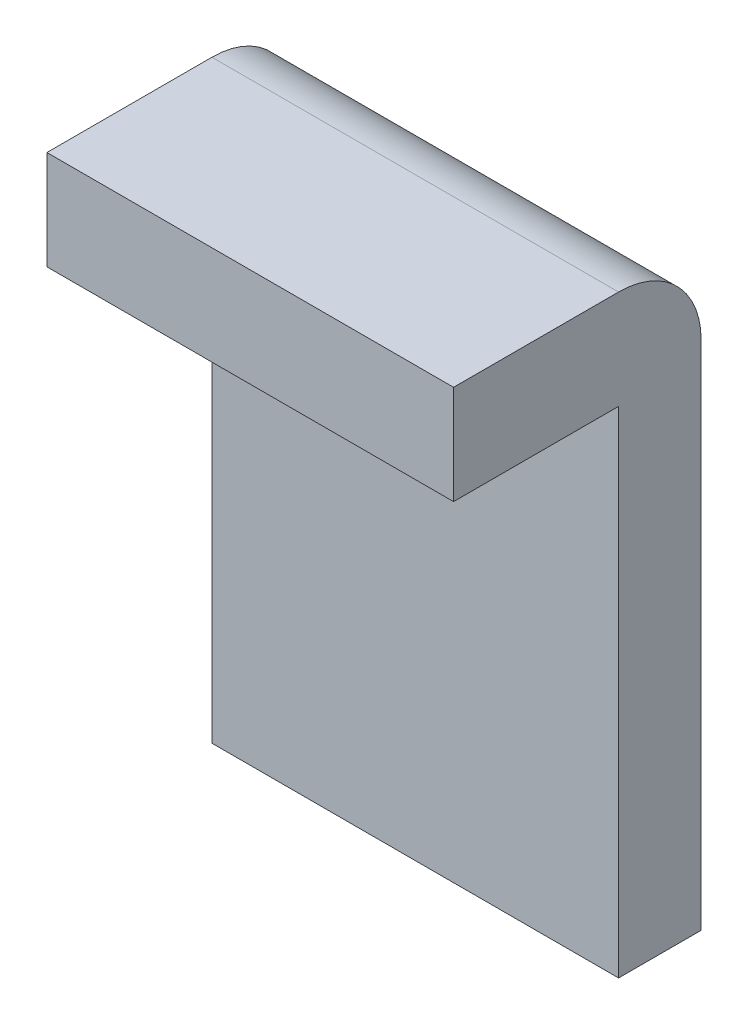
ISO-10303-21;
HEADER;
FILE_DESCRIPTION(('STEP AP214'),'2;1');
FILE_NAME('part.step','',(''),(''),'','','');
FILE_SCHEMA(('AUTOMOTIVE_DESIGN { 1 0 10303 214 1 1 1 1 }'));
ENDSEC;
DATA;
#1=APPLICATION_CONTEXT('core data for automotive mechanical design processes');
#2=APPLICATION_PROTOCOL_DEFINITION('international standard','automotive_design',2000,#1);
#3=PRODUCT_CONTEXT('',#1,'mechanical');
#4=PRODUCT('Part','Part','',(#3));
#5=PRODUCT_RELATED_PRODUCT_CATEGORY('part','',(#4));
#6=PRODUCT_DEFINITION_FORMATION('','',#4);
#7=PRODUCT_DEFINITION_CONTEXT('part definition',#1,'design');
#8=PRODUCT_DEFINITION('design','',#6,#7);
#9=PRODUCT_DEFINITION_SHAPE('','',#8);
#10=(LENGTH_UNIT() NAMED_UNIT(*) SI_UNIT(.MILLI.,.METRE.));
#11=(NAMED_UNIT(*) PLANE_ANGLE_UNIT() SI_UNIT($,.RADIAN.));
#12=(NAMED_UNIT(*) SI_UNIT($,.STERADIAN.) SOLID_ANGLE_UNIT());
#13=UNCERTAINTY_MEASURE_WITH_UNIT(LENGTH_MEASURE(1.E-05),#10,'distance_accuracy_value','');
#14=(GEOMETRIC_REPRESENTATION_CONTEXT(3) GLOBAL_UNCERTAINTY_ASSIGNED_CONTEXT((#13)) GLOBAL_UNIT_ASSIGNED_CONTEXT((#10,
#11,#12)) REPRESENTATION_CONTEXT('',''));
#15=CARTESIAN_POINT('',(0.,0.,0.));
#16=DIRECTION('',(0.,0.,1.));
#17=DIRECTION('',(1.,0.,0.));
#18=AXIS2_PLACEMENT_3D('',#15,#16,#17);
#19=CARTESIAN_POINT('',(-8.34906661620967,8.30000000000001,4.25467377707551));
#20=DIRECTION('',(0.,1.,0.));
#21=DIRECTION('',(0.,0.,1.));
#22=AXIS2_PLACEMENT_3D('',#19,#20,#21);
#23=PLANE('',#22);
#24=DIRECTION('',(1.,0.,0.));
#25=VECTOR('',#24,1.);
#26=CARTESIAN_POINT('',(26.7271967977103,8.30000000000001,4.25467377707551));
#27=LINE('',#26,#25);
#28=CARTESIAN_POINT('',(26.7271967977103,8.30000000000001,4.25467377707551));
#29=VERTEX_POINT('',#28);
#30=CARTESIAN_POINT('',(27.959347554151,8.30000000000001,4.25467377707551));
#31=VERTEX_POINT('',#30);
#32=EDGE_CURVE('E133',#29,#31,#27,.T.);
#33=ORIENTED_EDGE('',*,*,#32,.F.);
#34=DIRECTION('',(0.,0.,1.));
#35=VECTOR('',#34,1.);
#36=CARTESIAN_POINT('',(26.7271967977103,8.30000000000001,4.25467377707552));
#37=LINE('',#36,#35);
#38=CARTESIAN_POINT('',(26.7271967977103,8.30000000000001,3.75467377707551));
#39=VERTEX_POINT('',#38);
#40=EDGE_CURVE('E113',#39,#29,#37,.T.);
#41=ORIENTED_EDGE('',*,*,#40,.F.);
#42=DIRECTION('',(1.,0.,0.));
#43=VECTOR('',#42,1.);
#44=CARTESIAN_POINT('',(-8.34906661620967,8.30000000000001,3.75467377707551));
#45=LINE('',#44,#43);
#46=CARTESIAN_POINT('',(27.959347554151,8.30000000000001,3.75467377707551));
#47=VERTEX_POINT('',#46);
#48=EDGE_CURVE('E130',#39,#47,#45,.T.);
#49=ORIENTED_EDGE('',*,*,#48,.T.);
#50=DIRECTION('',(0.,0.,-1.));
#51=VECTOR('',#50,1.);
#52=CARTESIAN_POINT('',(27.959347554151,8.30000000000001,4.25467377707552));
#53=LINE('',#52,#51);
#54=EDGE_CURVE('E129',#31,#47,#53,.T.);
#55=ORIENTED_EDGE('',*,*,#54,.F.);
#56=EDGE_LOOP('',(#33,#41,#49,#55));
#57=FACE_BOUND('',#56,.T.);
#58=ADVANCED_FACE('F17',(#57),#23,.F.);
#59=CARTESIAN_POINT('',(26.7271967977103,5.35753839337144,4.25467377707552));
#60=DIRECTION('',(0.,0.,1.));
#61=DIRECTION('',(0.,-1.,0.));
#62=AXIS2_PLACEMENT_3D('',#59,#60,#61);
#63=PLANE('',#62);
#64=DIRECTION('',(1.,0.,0.));
#65=VECTOR('',#64,1.);
#66=CARTESIAN_POINT('',(-8.34906661620967,8.6,4.25467377707551));
#67=LINE('',#66,#65);
#68=CARTESIAN_POINT('',(27.959347554151,8.6,4.25467377707551));
#69=VERTEX_POINT('',#68);
#70=CARTESIAN_POINT('',(26.7271967977103,8.6,4.25467377707551));
#71=VERTEX_POINT('',#70);
#72=EDGE_CURVE('E131',#69,#71,#67,.F.);
#73=ORIENTED_EDGE('',*,*,#72,.T.);
#74=DIRECTION('',(0.,1.,0.));
#75=VECTOR('',#74,1.);
#76=CARTESIAN_POINT('',(26.7271967977103,5.35753839337144,4.25467377707551));
#77=LINE('',#76,#75);
#78=EDGE_CURVE('E136',#29,#71,#77,.T.);
#79=ORIENTED_EDGE('',*,*,#78,.F.);
#80=ORIENTED_EDGE('',*,*,#32,.T.);
#81=DIRECTION('',(0.,1.,0.));
#82=VECTOR('',#81,1.);
#83=CARTESIAN_POINT('',(27.959347554151,5.35753839337144,4.25467377707551));
#84=LINE('',#83,#82);
#85=EDGE_CURVE('E120',#69,#31,#84,.F.);
#86=ORIENTED_EDGE('',*,*,#85,.F.);
#87=EDGE_LOOP('',(#73,#79,#80,#86));
#88=FACE_BOUND('',#87,.T.);
#89=ADVANCED_FACE('F172',(#88),#63,.T.);
#90=CARTESIAN_POINT('',(-8.34906661620967,8.6,4.25467377707551));
#91=DIRECTION('',(0.,-1.,0.));
#92=DIRECTION('',(0.,0.,-1.));
#93=AXIS2_PLACEMENT_3D('',#90,#91,#92);
#94=PLANE('',#93);
#95=DIRECTION('',(1.,0.,0.));
#96=VECTOR('',#95,1.);
#97=CARTESIAN_POINT('',(-8.34906661620967,8.6,3.75467377707551));
#98=LINE('',#97,#96);
#99=CARTESIAN_POINT('',(26.7271967977103,8.6,3.7546737770755));
#100=VERTEX_POINT('',#99);
#101=CARTESIAN_POINT('',(27.959347554151,8.6,3.7546737770755));
#102=VERTEX_POINT('',#101);
#103=EDGE_CURVE('E79',#100,#102,#98,.T.);
#104=ORIENTED_EDGE('',*,*,#103,.F.);
#105=DIRECTION('',(0.,0.,1.));
#106=VECTOR('',#105,1.);
#107=CARTESIAN_POINT('',(26.7271967977103,8.6,4.25467377707552));
#108=LINE('',#107,#106);
#109=EDGE_CURVE('E139',#71,#100,#108,.F.);
#110=ORIENTED_EDGE('',*,*,#109,.F.);
#111=ORIENTED_EDGE('',*,*,#72,.F.);
#112=DIRECTION('',(0.,0.,-1.));
#113=VECTOR('',#112,1.);
#114=CARTESIAN_POINT('',(27.959347554151,8.6,4.25467377707552));
#115=LINE('',#114,#113);
#116=EDGE_CURVE('E83',#102,#69,#115,.F.);
#117=ORIENTED_EDGE('',*,*,#116,.F.);
#118=EDGE_LOOP('',(#104,#110,#111,#117));
#119=FACE_BOUND('',#118,.T.);
#120=ADVANCED_FACE('F169',(#119),#94,.F.);
#121=CARTESIAN_POINT('',(-8.34906661620967,8.30000000000001,3.75467377707551));
#122=DIRECTION('',(0.,0.,-1.));
#123=DIRECTION('',(0.,1.,0.));
#124=AXIS2_PLACEMENT_3D('',#121,#122,#123);
#125=PLANE('',#124);
#126=ORIENTED_EDGE('',*,*,#48,.F.);
#127=DIRECTION('',(0.,1.,0.));
#128=VECTOR('',#127,1.);
#129=CARTESIAN_POINT('',(26.7271967977103,5.35753839337144,3.75467377707551));
#130=LINE('',#129,#128);
#131=CARTESIAN_POINT('',(26.7271967977103,6.8,3.75467377707551));
#132=VERTEX_POINT('',#131);
#133=EDGE_CURVE('E95',#132,#39,#130,.T.);
#134=ORIENTED_EDGE('',*,*,#133,.F.);
#135=DIRECTION('',(1.,0.,0.));
#136=VECTOR('',#135,1.);
#137=CARTESIAN_POINT('',(-15.8147962412963,6.8,3.75467377707551));
#138=LINE('',#137,#136);
#139=CARTESIAN_POINT('',(27.959347554151,6.8,3.75467377707551));
#140=VERTEX_POINT('',#139);
#141=EDGE_CURVE('E114',#140,#132,#138,.F.);
#142=ORIENTED_EDGE('',*,*,#141,.F.);
#143=DIRECTION('',(0.,1.,0.));
#144=VECTOR('',#143,1.);
#145=CARTESIAN_POINT('',(27.959347554151,5.35753839337144,3.75467377707551));
#146=LINE('',#145,#144);
#147=EDGE_CURVE('E84',#47,#140,#146,.F.);
#148=ORIENTED_EDGE('',*,*,#147,.F.);
#149=EDGE_LOOP('',(#126,#134,#142,#148));
#150=FACE_BOUND('',#149,.T.);
#151=ADVANCED_FACE('F178',(#150),#125,.F.);
#152=CARTESIAN_POINT('',(-8.34906661620967,8.35,3.7546737770755));
#153=DIRECTION('',(1.,0.,0.));
#154=DIRECTION('',(0.,0.,-1.));
#155=AXIS2_PLACEMENT_3D('',#152,#153,#154);
#156=CYLINDRICAL_SURFACE('',#155,0.249999999999996);
#157=CARTESIAN_POINT('',(26.7271967977103,8.35,3.7546737770755));
#158=DIRECTION('',(1.,0.,0.));
#159=DIRECTION('',(0.,0.,-1.));
#160=AXIS2_PLACEMENT_3D('',#157,#158,#159);
#161=CIRCLE('',#160,0.249999999999996);
#162=CARTESIAN_POINT('',(26.7271967977103,8.35,3.50467377707551));
#163=VERTEX_POINT('',#162);
#164=EDGE_CURVE('E106',#100,#163,#161,.F.);
#165=ORIENTED_EDGE('',*,*,#164,.F.);
#166=ORIENTED_EDGE('',*,*,#103,.T.);
#167=CARTESIAN_POINT('',(27.959347554151,8.35,3.7546737770755));
#168=DIRECTION('',(1.,0.,0.));
#169=DIRECTION('',(0.,0.,-1.));
#170=AXIS2_PLACEMENT_3D('',#167,#168,#169);
#171=CIRCLE('',#170,0.249999999999996);
#172=CARTESIAN_POINT('',(27.959347554151,8.35,3.50467377707551));
#173=VERTEX_POINT('',#172);
#174=EDGE_CURVE('E20',#173,#102,#171,.T.);
#175=ORIENTED_EDGE('',*,*,#174,.F.);
#176=DIRECTION('',(1.,0.,0.));
#177=VECTOR('',#176,1.);
#178=CARTESIAN_POINT('',(26.7271967977103,8.35,3.50467377707551));
#179=LINE('',#178,#177);
#180=EDGE_CURVE('E77',#163,#173,#179,.T.);
#181=ORIENTED_EDGE('',*,*,#180,.F.);
#182=EDGE_LOOP('',(#165,#166,#175,#181));
#183=FACE_BOUND('',#182,.T.);
#184=ADVANCED_FACE('F75',(#183),#156,.T.);
#185=CARTESIAN_POINT('',(27.959347554151,5.35753839337144,4.25467377707552));
#186=DIRECTION('',(1.,0.,0.));
#187=DIRECTION('',(0.,0.,-1.));
#188=AXIS2_PLACEMENT_3D('',#185,#186,#187);
#189=PLANE('',#188);
#190=ORIENTED_EDGE('',*,*,#116,.T.);
#191=ORIENTED_EDGE('',*,*,#85,.T.);
#192=ORIENTED_EDGE('',*,*,#54,.T.);
#193=ORIENTED_EDGE('',*,*,#147,.T.);
#194=DIRECTION('',(0.,0.,-1.));
#195=VECTOR('',#194,1.);
#196=CARTESIAN_POINT('',(27.959347554151,6.80000000000003,12.5046737770755));
#197=LINE('',#196,#195);
#198=CARTESIAN_POINT('',(27.959347554151,6.8,3.50467377707552));
#199=VERTEX_POINT('',#198);
#200=EDGE_CURVE('E90',#199,#140,#197,.F.);
#201=ORIENTED_EDGE('',*,*,#200,.F.);
#202=DIRECTION('',(0.,1.,0.));
#203=VECTOR('',#202,1.);
#204=CARTESIAN_POINT('',(27.959347554151,5.35753839337143,3.50467377707552));
#205=LINE('',#204,#203);
#206=EDGE_CURVE('E86',#173,#199,#205,.F.);
#207=ORIENTED_EDGE('',*,*,#206,.F.);
#208=ORIENTED_EDGE('',*,*,#174,.T.);
#209=EDGE_LOOP('',(#190,#191,#192,#193,#201,#207,#208));
#210=FACE_BOUND('',#209,.T.);
#211=ADVANCED_FACE('F87',(#210),#189,.T.);
#212=CARTESIAN_POINT('',(-15.8147962412963,6.80000000000003,12.5046737770755));
#213=DIRECTION('',(0.,-1.,0.));
#214=DIRECTION('',(0.,0.,-1.));
#215=AXIS2_PLACEMENT_3D('',#212,#213,#214);
#216=PLANE('',#215);
#217=DIRECTION('',(1.,0.,0.));
#218=VECTOR('',#217,1.);
#219=CARTESIAN_POINT('',(26.7271967977103,6.8,3.50467377707552));
#220=LINE('',#219,#218);
#221=CARTESIAN_POINT('',(26.7271967977103,6.8,3.50467377707552));
#222=VERTEX_POINT('',#221);
#223=EDGE_CURVE('E26',#199,#222,#220,.F.);
#224=ORIENTED_EDGE('',*,*,#223,.F.);
#225=ORIENTED_EDGE('',*,*,#200,.T.);
#226=ORIENTED_EDGE('',*,*,#141,.T.);
#227=DIRECTION('',(0.,0.,1.));
#228=VECTOR('',#227,1.);
#229=CARTESIAN_POINT('',(26.7271967977103,6.8,4.25467377707552));
#230=LINE('',#229,#228);
#231=EDGE_CURVE('E35',#222,#132,#230,.T.);
#232=ORIENTED_EDGE('',*,*,#231,.F.);
#233=EDGE_LOOP('',(#224,#225,#226,#232));
#234=FACE_BOUND('',#233,.T.);
#235=ADVANCED_FACE('F179',(#234),#216,.T.);
#236=CARTESIAN_POINT('',(26.7271967977103,5.35753839337144,4.25467377707552));
#237=DIRECTION('',(-1.,0.,0.));
#238=DIRECTION('',(0.,0.,1.));
#239=AXIS2_PLACEMENT_3D('',#236,#237,#238);
#240=PLANE('',#239);
#241=ORIENTED_EDGE('',*,*,#231,.T.);
#242=ORIENTED_EDGE('',*,*,#133,.T.);
#243=ORIENTED_EDGE('',*,*,#40,.T.);
#244=ORIENTED_EDGE('',*,*,#78,.T.);
#245=ORIENTED_EDGE('',*,*,#109,.T.);
#246=ORIENTED_EDGE('',*,*,#164,.T.);
#247=DIRECTION('',(0.,1.,0.));
#248=VECTOR('',#247,1.);
#249=CARTESIAN_POINT('',(26.7271967977103,5.35753839337143,3.50467377707552));
#250=LINE('',#249,#248);
#251=EDGE_CURVE('E11',#222,#163,#250,.T.);
#252=ORIENTED_EDGE('',*,*,#251,.F.);
#253=EDGE_LOOP('',(#241,#242,#243,#244,#245,#246,#252));
#254=FACE_BOUND('',#253,.T.);
#255=ADVANCED_FACE('F166',(#254),#240,.T.);
#256=CARTESIAN_POINT('',(26.7271967977103,5.35753839337143,3.50467377707552));
#257=DIRECTION('',(0.,0.,-1.));
#258=DIRECTION('',(0.,1.,0.));
#259=AXIS2_PLACEMENT_3D('',#256,#257,#258);
#260=PLANE('',#259);
#261=ORIENTED_EDGE('',*,*,#223,.T.);
#262=ORIENTED_EDGE('',*,*,#251,.T.);
#263=ORIENTED_EDGE('',*,*,#180,.T.);
#264=ORIENTED_EDGE('',*,*,#206,.T.);
#265=EDGE_LOOP('',(#261,#262,#263,#264));
#266=FACE_BOUND('',#265,.T.);
#267=ADVANCED_FACE('F94',(#266),#260,.T.);
#268=CLOSED_SHELL('',(#58,#89,#120,#151,#184,#211,#235,#255,#267));
#269=MANIFOLD_SOLID_BREP('B1',#268);
#270=ADVANCED_BREP_SHAPE_REPRESENTATION('',(#18,#269),#14);
#271=SHAPE_DEFINITION_REPRESENTATION(#9,#270);
ENDSEC;
END-ISO-10303-21;
